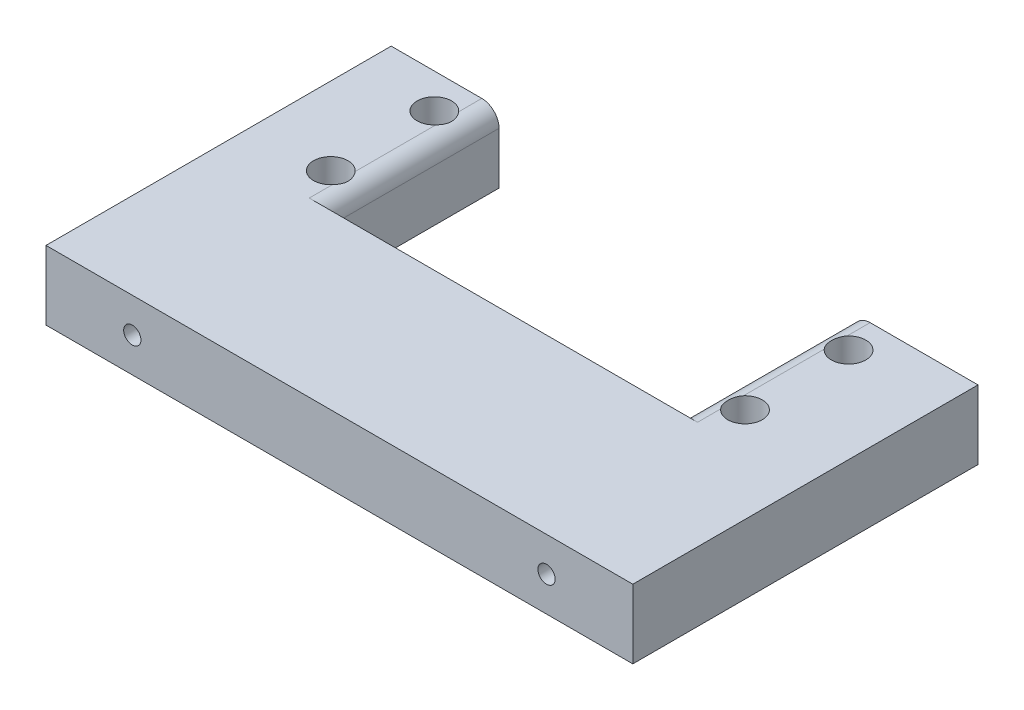
ISO-10303-21;
HEADER;
FILE_DESCRIPTION(('STEP AP214'),'2;1');
FILE_NAME('part.step','',(''),(''),'','','');
FILE_SCHEMA(('AUTOMOTIVE_DESIGN { 1 0 10303 214 1 1 1 1 }'));
ENDSEC;
DATA;
#1=APPLICATION_CONTEXT('core data for automotive mechanical design processes');
#2=APPLICATION_PROTOCOL_DEFINITION('international standard','automotive_design',2000,#1);
#3=PRODUCT_CONTEXT('',#1,'mechanical');
#4=PRODUCT('Part','Part','',(#3));
#5=PRODUCT_RELATED_PRODUCT_CATEGORY('part','',(#4));
#6=PRODUCT_DEFINITION_FORMATION('','',#4);
#7=PRODUCT_DEFINITION_CONTEXT('part definition',#1,'design');
#8=PRODUCT_DEFINITION('design','',#6,#7);
#9=PRODUCT_DEFINITION_SHAPE('','',#8);
#10=(LENGTH_UNIT() NAMED_UNIT(*) SI_UNIT(.MILLI.,.METRE.));
#11=(NAMED_UNIT(*) PLANE_ANGLE_UNIT() SI_UNIT($,.RADIAN.));
#12=(NAMED_UNIT(*) SI_UNIT($,.STERADIAN.) SOLID_ANGLE_UNIT());
#13=UNCERTAINTY_MEASURE_WITH_UNIT(LENGTH_MEASURE(1.E-05),#10,'distance_accuracy_value','');
#14=(GEOMETRIC_REPRESENTATION_CONTEXT(3) GLOBAL_UNCERTAINTY_ASSIGNED_CONTEXT((#13)) GLOBAL_UNIT_ASSIGNED_CONTEXT((#10,
#11,#12)) REPRESENTATION_CONTEXT('',''));
#15=CARTESIAN_POINT('',(0.,0.,0.));
#16=DIRECTION('',(0.,0.,1.));
#17=DIRECTION('',(1.,0.,0.));
#18=AXIS2_PLACEMENT_3D('',#15,#16,#17);
#19=CARTESIAN_POINT('',(0.,8.,0.));
#20=DIRECTION('',(0.,1.,0.));
#21=DIRECTION('',(0.,0.,1.));
#22=AXIS2_PLACEMENT_3D('',#19,#20,#21);
#23=PLANE('',#22);
#24=CARTESIAN_POINT('',(-25.4524886877828,8.,-6.27896621397598));
#25=DIRECTION('',(0.,1.,0.));
#26=DIRECTION('',(0.,0.,1.));
#27=AXIS2_PLACEMENT_3D('',#24,#25,#26);
#28=CIRCLE('',#27,2.);
#29=CARTESIAN_POINT('',(-23.9524886877828,8.,-7.60184186950828));
#30=VERTEX_POINT('',#29);
#31=CARTESIAN_POINT('',(-23.9524886877828,8.,-4.95609055844368));
#32=VERTEX_POINT('',#31);
#33=EDGE_CURVE('E251',#30,#32,#28,.T.);
#34=ORIENTED_EDGE('',*,*,#33,.F.);
#35=DIRECTION('',(0.,0.,-1.));
#36=VECTOR('',#35,1.);
#37=CARTESIAN_POINT('',(-23.9524886877828,8.,-22.278966213976));
#38=LINE('',#37,#36);
#39=CARTESIAN_POINT('',(-23.9524886877828,8.,-16.9560905584437));
#40=VERTEX_POINT('',#39);
#41=EDGE_CURVE('E177',#30,#40,#38,.T.);
#42=ORIENTED_EDGE('',*,*,#41,.T.);
#43=CARTESIAN_POINT('',(-25.4524886877828,8.,-18.278966213976));
#44=DIRECTION('',(0.,1.,0.));
#45=DIRECTION('',(0.,0.,1.));
#46=AXIS2_PLACEMENT_3D('',#43,#44,#45);
#47=CIRCLE('',#46,2.);
#48=CARTESIAN_POINT('',(-23.9524886877828,8.,-19.6018418695083));
#49=VERTEX_POINT('',#48);
#50=EDGE_CURVE('E245',#49,#40,#47,.T.);
#51=ORIENTED_EDGE('',*,*,#50,.F.);
#52=DIRECTION('',(0.,0.,-1.));
#53=VECTOR('',#52,1.);
#54=CARTESIAN_POINT('',(-23.9524886877828,8.,-22.278966213976));
#55=LINE('',#54,#53);
#56=CARTESIAN_POINT('',(-23.9524886877828,8.,-22.278966213976));
#57=VERTEX_POINT('',#56);
#58=EDGE_CURVE('E175',#49,#57,#55,.T.);
#59=ORIENTED_EDGE('',*,*,#58,.T.);
#60=DIRECTION('',(-1.,0.,0.));
#61=VECTOR('',#60,1.);
#62=CARTESIAN_POINT('',(-34.4524886877828,8.,-22.278966213976));
#63=LINE('',#62,#61);
#64=CARTESIAN_POINT('',(-34.4524886877828,8.,-22.278966213976));
#65=VERTEX_POINT('',#64);
#66=EDGE_CURVE('E150',#57,#65,#63,.T.);
#67=ORIENTED_EDGE('',*,*,#66,.T.);
#68=DIRECTION('',(0.,0.,1.));
#69=VECTOR('',#68,1.);
#70=CARTESIAN_POINT('',(-34.4524886877828,8.,-22.278966213976));
#71=LINE('',#70,#69);
#72=CARTESIAN_POINT('',(-34.4524886877828,8.,17.721033786024));
#73=VERTEX_POINT('',#72);
#74=EDGE_CURVE('E145',#65,#73,#71,.T.);
#75=ORIENTED_EDGE('',*,*,#74,.T.);
#76=DIRECTION('',(1.,0.,0.));
#77=VECTOR('',#76,1.);
#78=CARTESIAN_POINT('',(-34.4524886877828,8.,17.721033786024));
#79=LINE('',#78,#77);
#80=CARTESIAN_POINT('',(33.5475113122172,8.,17.721033786024));
#81=VERTEX_POINT('',#80);
#82=EDGE_CURVE('E134',#73,#81,#79,.T.);
#83=ORIENTED_EDGE('',*,*,#82,.T.);
#84=DIRECTION('',(0.,0.,-1.));
#85=VECTOR('',#84,1.);
#86=CARTESIAN_POINT('',(33.5475113122172,8.,-22.278966213976));
#87=LINE('',#86,#85);
#88=CARTESIAN_POINT('',(33.5475113122172,8.,-22.278966213976));
#89=VERTEX_POINT('',#88);
#90=EDGE_CURVE('E144',#81,#89,#87,.T.);
#91=ORIENTED_EDGE('',*,*,#90,.T.);
#92=DIRECTION('',(-1.,0.,0.));
#93=VECTOR('',#92,1.);
#94=CARTESIAN_POINT('',(19.0475113122172,8.,-22.278966213976));
#95=LINE('',#94,#93);
#96=CARTESIAN_POINT('',(21.0475113122172,8.,-22.278966213976));
#97=VERTEX_POINT('',#96);
#98=EDGE_CURVE('E260',#89,#97,#95,.T.);
#99=ORIENTED_EDGE('',*,*,#98,.T.);
#100=DIRECTION('',(0.,0.,1.));
#101=VECTOR('',#100,1.);
#102=CARTESIAN_POINT('',(21.0475113122172,8.,-2.27896621397598));
#103=LINE('',#102,#101);
#104=CARTESIAN_POINT('',(21.0475113122172,8.,-19.6018418695083));
#105=VERTEX_POINT('',#104);
#106=EDGE_CURVE('E169',#97,#105,#103,.T.);
#107=ORIENTED_EDGE('',*,*,#106,.T.);
#108=CARTESIAN_POINT('',(22.5475113122172,8.,-18.278966213976));
#109=DIRECTION('',(0.,1.,0.));
#110=DIRECTION('',(0.,0.,1.));
#111=AXIS2_PLACEMENT_3D('',#108,#109,#110);
#112=CIRCLE('',#111,2.);
#113=CARTESIAN_POINT('',(21.0475113122172,8.,-16.9560905584437));
#114=VERTEX_POINT('',#113);
#115=EDGE_CURVE('E335',#114,#105,#112,.T.);
#116=ORIENTED_EDGE('',*,*,#115,.F.);
#117=DIRECTION('',(0.,0.,1.));
#118=VECTOR('',#117,1.);
#119=CARTESIAN_POINT('',(21.0475113122172,8.,-2.27896621397598));
#120=LINE('',#119,#118);
#121=CARTESIAN_POINT('',(21.0475113122172,8.,-7.60184186950828));
#122=VERTEX_POINT('',#121);
#123=EDGE_CURVE('E162',#114,#122,#120,.T.);
#124=ORIENTED_EDGE('',*,*,#123,.T.);
#125=CARTESIAN_POINT('',(22.5475113122172,8.,-6.27896621397598));
#126=DIRECTION('',(0.,1.,0.));
#127=DIRECTION('',(0.,0.,1.));
#128=AXIS2_PLACEMENT_3D('',#125,#126,#127);
#129=CIRCLE('',#128,2.);
#130=CARTESIAN_POINT('',(21.0475113122172,8.,-4.95609055844369));
#131=VERTEX_POINT('',#130);
#132=EDGE_CURVE('E340',#131,#122,#129,.T.);
#133=ORIENTED_EDGE('',*,*,#132,.F.);
#134=DIRECTION('',(0.,0.,1.));
#135=VECTOR('',#134,1.);
#136=CARTESIAN_POINT('',(21.0475113122172,8.,-2.27896621397598));
#137=LINE('',#136,#135);
#138=CARTESIAN_POINT('',(21.0475113122172,8.,-2.27896621397598));
#139=VERTEX_POINT('',#138);
#140=EDGE_CURVE('E159',#131,#139,#137,.T.);
#141=ORIENTED_EDGE('',*,*,#140,.T.);
#142=DIRECTION('',(-1.,0.,0.));
#143=VECTOR('',#142,1.);
#144=CARTESIAN_POINT('',(-21.9524886877828,8.,-2.27896621397598));
#145=LINE('',#144,#143);
#146=CARTESIAN_POINT('',(-23.9524886877828,8.,-2.27896621397598));
#147=VERTEX_POINT('',#146);
#148=EDGE_CURVE('E263',#139,#147,#145,.T.);
#149=ORIENTED_EDGE('',*,*,#148,.T.);
#150=DIRECTION('',(0.,0.,-1.));
#151=VECTOR('',#150,1.);
#152=CARTESIAN_POINT('',(-23.9524886877828,8.,-22.278966213976));
#153=LINE('',#152,#151);
#154=EDGE_CURVE('E172',#147,#32,#153,.T.);
#155=ORIENTED_EDGE('',*,*,#154,.T.);
#156=EDGE_LOOP('',(#34,#42,#51,#59,#67,#75,#83,#91,#99,#107,#116,#124,#133,#141,#149,#155));
#157=FACE_BOUND('',#156,.T.);
#158=ADVANCED_FACE('F34',(#157),#23,.T.);
#159=CARTESIAN_POINT('',(0.,0.,0.));
#160=DIRECTION('',(0.,1.,0.));
#161=DIRECTION('',(0.,0.,1.));
#162=AXIS2_PLACEMENT_3D('',#159,#160,#161);
#163=PLANE('',#162);
#164=DIRECTION('',(0.,0.,1.));
#165=VECTOR('',#164,1.);
#166=CARTESIAN_POINT('',(-34.4524886877828,0.,-22.278966213976));
#167=LINE('',#166,#165);
#168=CARTESIAN_POINT('',(-34.4524886877828,0.,-22.278966213976));
#169=VERTEX_POINT('',#168);
#170=CARTESIAN_POINT('',(-34.4524886877828,0.,17.721033786024));
#171=VERTEX_POINT('',#170);
#172=EDGE_CURVE('E158',#169,#171,#167,.T.);
#173=ORIENTED_EDGE('',*,*,#172,.F.);
#174=DIRECTION('',(-1.,0.,0.));
#175=VECTOR('',#174,1.);
#176=CARTESIAN_POINT('',(-34.4524886877828,0.,-22.278966213976));
#177=LINE('',#176,#175);
#178=CARTESIAN_POINT('',(-21.9524886877828,0.,-22.278966213976));
#179=VERTEX_POINT('',#178);
#180=EDGE_CURVE('E154',#179,#169,#177,.T.);
#181=ORIENTED_EDGE('',*,*,#180,.F.);
#182=DIRECTION('',(0.,0.,-1.));
#183=VECTOR('',#182,1.);
#184=CARTESIAN_POINT('',(-21.9524886877828,0.,-22.278966213976));
#185=LINE('',#184,#183);
#186=CARTESIAN_POINT('',(-21.9524886877828,0.,-2.27896621397598));
#187=VERTEX_POINT('',#186);
#188=EDGE_CURVE('E281',#187,#179,#185,.T.);
#189=ORIENTED_EDGE('',*,*,#188,.F.);
#190=DIRECTION('',(-1.,0.,0.));
#191=VECTOR('',#190,1.);
#192=CARTESIAN_POINT('',(-21.9524886877828,0.,-2.27896621397598));
#193=LINE('',#192,#191);
#194=CARTESIAN_POINT('',(19.0475113122172,0.,-2.27896621397598));
#195=VERTEX_POINT('',#194);
#196=EDGE_CURVE('E278',#195,#187,#193,.T.);
#197=ORIENTED_EDGE('',*,*,#196,.F.);
#198=DIRECTION('',(0.,0.,1.));
#199=VECTOR('',#198,1.);
#200=CARTESIAN_POINT('',(19.0475113122172,0.,-22.278966213976));
#201=LINE('',#200,#199);
#202=CARTESIAN_POINT('',(19.0475113122172,0.,-22.278966213976));
#203=VERTEX_POINT('',#202);
#204=EDGE_CURVE('E275',#203,#195,#201,.T.);
#205=ORIENTED_EDGE('',*,*,#204,.F.);
#206=DIRECTION('',(-1.,0.,0.));
#207=VECTOR('',#206,1.);
#208=CARTESIAN_POINT('',(19.0475113122172,0.,-22.278966213976));
#209=LINE('',#208,#207);
#210=CARTESIAN_POINT('',(33.5475113122172,0.,-22.278966213976));
#211=VERTEX_POINT('',#210);
#212=EDGE_CURVE('E272',#211,#203,#209,.T.);
#213=ORIENTED_EDGE('',*,*,#212,.F.);
#214=DIRECTION('',(0.,0.,-1.));
#215=VECTOR('',#214,1.);
#216=CARTESIAN_POINT('',(33.5475113122172,0.,-22.278966213976));
#217=LINE('',#216,#215);
#218=CARTESIAN_POINT('',(33.5475113122172,0.,17.721033786024));
#219=VERTEX_POINT('',#218);
#220=EDGE_CURVE('E270',#219,#211,#217,.T.);
#221=ORIENTED_EDGE('',*,*,#220,.F.);
#222=DIRECTION('',(1.,0.,0.));
#223=VECTOR('',#222,1.);
#224=CARTESIAN_POINT('',(-34.4524886877828,0.,17.721033786024));
#225=LINE('',#224,#223);
#226=EDGE_CURVE('E268',#171,#219,#225,.T.);
#227=ORIENTED_EDGE('',*,*,#226,.F.);
#228=EDGE_LOOP('',(#173,#181,#189,#197,#205,#213,#221,#227));
#229=FACE_BOUND('',#228,.T.);
#230=CARTESIAN_POINT('',(-25.4524886877828,0.,-18.278966213976));
#231=DIRECTION('',(0.,1.,0.));
#232=DIRECTION('',(0.,0.,1.));
#233=AXIS2_PLACEMENT_3D('',#230,#231,#232);
#234=CIRCLE('',#233,2.);
#235=CARTESIAN_POINT('',(-25.4524886877828,0.,-16.278966213976));
#236=VERTEX_POINT('',#235);
#237=EDGE_CURVE('E249',#236,#236,#234,.T.);
#238=ORIENTED_EDGE('',*,*,#237,.T.);
#239=EDGE_LOOP('',(#238));
#240=FACE_BOUND('',#239,.T.);
#241=CARTESIAN_POINT('',(-25.4524886877828,0.,-6.27896621397598));
#242=DIRECTION('',(0.,1.,0.));
#243=DIRECTION('',(0.,0.,1.));
#244=AXIS2_PLACEMENT_3D('',#241,#242,#243);
#245=CIRCLE('',#244,2.);
#246=CARTESIAN_POINT('',(-25.4524886877828,0.,-4.27896621397598));
#247=VERTEX_POINT('',#246);
#248=EDGE_CURVE('E255',#247,#247,#245,.T.);
#249=ORIENTED_EDGE('',*,*,#248,.T.);
#250=EDGE_LOOP('',(#249));
#251=FACE_BOUND('',#250,.T.);
#252=CARTESIAN_POINT('',(22.5475113122172,0.,-18.278966213976));
#253=DIRECTION('',(0.,1.,0.));
#254=DIRECTION('',(0.,0.,1.));
#255=AXIS2_PLACEMENT_3D('',#252,#253,#254);
#256=CIRCLE('',#255,2.);
#257=CARTESIAN_POINT('',(22.5475113122172,0.,-16.278966213976));
#258=VERTEX_POINT('',#257);
#259=EDGE_CURVE('E338',#258,#258,#256,.T.);
#260=ORIENTED_EDGE('',*,*,#259,.T.);
#261=EDGE_LOOP('',(#260));
#262=FACE_BOUND('',#261,.T.);
#263=CARTESIAN_POINT('',(22.5475113122172,0.,-6.27896621397598));
#264=DIRECTION('',(0.,1.,0.));
#265=DIRECTION('',(0.,0.,1.));
#266=AXIS2_PLACEMENT_3D('',#263,#264,#265);
#267=CIRCLE('',#266,2.);
#268=CARTESIAN_POINT('',(22.5475113122172,0.,-4.27896621397598));
#269=VERTEX_POINT('',#268);
#270=EDGE_CURVE('E344',#269,#269,#267,.T.);
#271=ORIENTED_EDGE('',*,*,#270,.T.);
#272=EDGE_LOOP('',(#271));
#273=FACE_BOUND('',#272,.T.);
#274=ADVANCED_FACE('F203',(#229,#240,#251,#262,#273),#163,.F.);
#275=CARTESIAN_POINT('',(-34.4524886877828,8.,-22.278966213976));
#276=DIRECTION('',(1.,0.,0.));
#277=DIRECTION('',(0.,0.,-1.));
#278=AXIS2_PLACEMENT_3D('',#275,#276,#277);
#279=PLANE('',#278);
#280=ORIENTED_EDGE('',*,*,#172,.T.);
#281=DIRECTION('',(0.,-1.,0.));
#282=VECTOR('',#281,1.);
#283=CARTESIAN_POINT('',(-34.4524886877828,8.,17.721033786024));
#284=LINE('',#283,#282);
#285=EDGE_CURVE('E138',#73,#171,#284,.T.);
#286=ORIENTED_EDGE('',*,*,#285,.F.);
#287=ORIENTED_EDGE('',*,*,#74,.F.);
#288=DIRECTION('',(0.,-1.,0.));
#289=VECTOR('',#288,1.);
#290=CARTESIAN_POINT('',(-34.4524886877828,8.,-22.278966213976));
#291=LINE('',#290,#289);
#292=EDGE_CURVE('E266',#65,#169,#291,.T.);
#293=ORIENTED_EDGE('',*,*,#292,.T.);
#294=EDGE_LOOP('',(#280,#286,#287,#293));
#295=FACE_BOUND('',#294,.T.);
#296=ADVANCED_FACE('F156',(#295),#279,.F.);
#297=CARTESIAN_POINT('',(-34.4524886877828,8.,17.721033786024));
#298=DIRECTION('',(0.,0.,-1.));
#299=DIRECTION('',(-1.,0.,0.));
#300=AXIS2_PLACEMENT_3D('',#297,#298,#299);
#301=PLANE('',#300);
#302=CARTESIAN_POINT('',(23.5475113122172,4.,17.721033786024));
#303=DIRECTION('',(0.,0.,-1.));
#304=DIRECTION('',(-1.,0.,0.));
#305=AXIS2_PLACEMENT_3D('',#302,#303,#304);
#306=CIRCLE('',#305,0.999999999999998);
#307=CARTESIAN_POINT('',(22.5475113122172,4.,17.721033786024));
#308=VERTEX_POINT('',#307);
#309=EDGE_CURVE('E363',#308,#308,#306,.T.);
#310=ORIENTED_EDGE('',*,*,#309,.T.);
#311=EDGE_LOOP('',(#310));
#312=FACE_BOUND('',#311,.T.);
#313=CARTESIAN_POINT('',(-24.4524886877828,4.,17.721033786024));
#314=DIRECTION('',(0.,0.,-1.));
#315=DIRECTION('',(-1.,0.,0.));
#316=AXIS2_PLACEMENT_3D('',#313,#314,#315);
#317=CIRCLE('',#316,1.);
#318=CARTESIAN_POINT('',(-25.4524886877828,4.,17.721033786024));
#319=VERTEX_POINT('',#318);
#320=EDGE_CURVE('E357',#319,#319,#317,.T.);
#321=ORIENTED_EDGE('',*,*,#320,.T.);
#322=EDGE_LOOP('',(#321));
#323=FACE_BOUND('',#322,.T.);
#324=ORIENTED_EDGE('',*,*,#226,.T.);
#325=DIRECTION('',(0.,-1.,0.));
#326=VECTOR('',#325,1.);
#327=CARTESIAN_POINT('',(33.5475113122172,8.,17.721033786024));
#328=LINE('',#327,#326);
#329=EDGE_CURVE('E141',#81,#219,#328,.T.);
#330=ORIENTED_EDGE('',*,*,#329,.F.);
#331=ORIENTED_EDGE('',*,*,#82,.F.);
#332=ORIENTED_EDGE('',*,*,#285,.T.);
#333=EDGE_LOOP('',(#324,#330,#331,#332));
#334=FACE_BOUND('',#333,.T.);
#335=ADVANCED_FACE('F136',(#312,#323,#334),#301,.F.);
#336=CARTESIAN_POINT('',(33.5475113122172,8.,-22.278966213976));
#337=DIRECTION('',(-1.,0.,0.));
#338=DIRECTION('',(0.,0.,1.));
#339=AXIS2_PLACEMENT_3D('',#336,#337,#338);
#340=PLANE('',#339);
#341=ORIENTED_EDGE('',*,*,#220,.T.);
#342=DIRECTION('',(0.,-1.,0.));
#343=VECTOR('',#342,1.);
#344=CARTESIAN_POINT('',(33.5475113122172,8.,-22.278966213976));
#345=LINE('',#344,#343);
#346=EDGE_CURVE('E164',#89,#211,#345,.T.);
#347=ORIENTED_EDGE('',*,*,#346,.F.);
#348=ORIENTED_EDGE('',*,*,#90,.F.);
#349=ORIENTED_EDGE('',*,*,#329,.T.);
#350=EDGE_LOOP('',(#341,#347,#348,#349));
#351=FACE_BOUND('',#350,.T.);
#352=ADVANCED_FACE('F206',(#351),#340,.F.);
#353=CARTESIAN_POINT('',(19.0475113122172,8.,-22.278966213976));
#354=DIRECTION('',(0.,0.,1.));
#355=DIRECTION('',(1.,0.,0.));
#356=AXIS2_PLACEMENT_3D('',#353,#354,#355);
#357=PLANE('',#356);
#358=DIRECTION('',(0.,-1.,0.));
#359=VECTOR('',#358,1.);
#360=CARTESIAN_POINT('',(19.0475113122172,8.,-22.278966213976));
#361=LINE('',#360,#359);
#362=CARTESIAN_POINT('',(19.0475113122172,6.,-22.278966213976));
#363=VERTEX_POINT('',#362);
#364=EDGE_CURVE('E292',#363,#203,#361,.T.);
#365=ORIENTED_EDGE('',*,*,#364,.F.);
#366=CARTESIAN_POINT('',(21.0475113122172,6.,-22.278966213976));
#367=DIRECTION('',(0.,0.,1.));
#368=DIRECTION('',(1.,0.,0.));
#369=AXIS2_PLACEMENT_3D('',#366,#367,#368);
#370=CIRCLE('',#369,2.);
#371=EDGE_CURVE('E302',#363,#97,#370,.F.);
#372=ORIENTED_EDGE('',*,*,#371,.T.);
#373=ORIENTED_EDGE('',*,*,#98,.F.);
#374=ORIENTED_EDGE('',*,*,#346,.T.);
#375=ORIENTED_EDGE('',*,*,#212,.T.);
#376=EDGE_LOOP('',(#365,#372,#373,#374,#375));
#377=FACE_BOUND('',#376,.T.);
#378=ADVANCED_FACE('F210',(#377),#357,.F.);
#379=CARTESIAN_POINT('',(19.0475113122172,8.,-22.278966213976));
#380=DIRECTION('',(1.,0.,0.));
#381=DIRECTION('',(0.,0.,-1.));
#382=AXIS2_PLACEMENT_3D('',#379,#380,#381);
#383=PLANE('',#382);
#384=DIRECTION('',(0.,-1.,0.));
#385=VECTOR('',#384,1.);
#386=CARTESIAN_POINT('',(19.0475113122172,8.,-2.27896621397598));
#387=LINE('',#386,#385);
#388=CARTESIAN_POINT('',(19.0475113122172,6.,-2.27896621397598));
#389=VERTEX_POINT('',#388);
#390=EDGE_CURVE('E290',#389,#195,#387,.T.);
#391=ORIENTED_EDGE('',*,*,#390,.F.);
#392=DIRECTION('',(0.,0.,1.));
#393=VECTOR('',#392,1.);
#394=CARTESIAN_POINT('',(19.0475113122172,6.,-22.278966213976));
#395=LINE('',#394,#393);
#396=EDGE_CURVE('E50',#389,#363,#395,.F.);
#397=ORIENTED_EDGE('',*,*,#396,.T.);
#398=ORIENTED_EDGE('',*,*,#364,.T.);
#399=ORIENTED_EDGE('',*,*,#204,.T.);
#400=EDGE_LOOP('',(#391,#397,#398,#399));
#401=FACE_BOUND('',#400,.T.);
#402=ADVANCED_FACE('F214',(#401),#383,.F.);
#403=CARTESIAN_POINT('',(-21.9524886877828,8.,-2.27896621397598));
#404=DIRECTION('',(0.,0.,1.));
#405=DIRECTION('',(1.,0.,0.));
#406=AXIS2_PLACEMENT_3D('',#403,#404,#405);
#407=PLANE('',#406);
#408=ORIENTED_EDGE('',*,*,#196,.T.);
#409=DIRECTION('',(0.,-1.,0.));
#410=VECTOR('',#409,1.);
#411=CARTESIAN_POINT('',(-21.9524886877828,8.,-2.27896621397598));
#412=LINE('',#411,#410);
#413=CARTESIAN_POINT('',(-21.9524886877828,6.,-2.27896621397598));
#414=VERTEX_POINT('',#413);
#415=EDGE_CURVE('E288',#414,#187,#412,.T.);
#416=ORIENTED_EDGE('',*,*,#415,.F.);
#417=CARTESIAN_POINT('',(-23.9524886877828,6.,-2.27896621397598));
#418=DIRECTION('',(0.,0.,1.));
#419=DIRECTION('',(1.,0.,0.));
#420=AXIS2_PLACEMENT_3D('',#417,#418,#419);
#421=CIRCLE('',#420,2.);
#422=EDGE_CURVE('E43',#414,#147,#421,.T.);
#423=ORIENTED_EDGE('',*,*,#422,.T.);
#424=ORIENTED_EDGE('',*,*,#148,.F.);
#425=CARTESIAN_POINT('',(21.0475113122172,6.,-2.27896621397598));
#426=DIRECTION('',(0.,0.,1.));
#427=DIRECTION('',(1.,0.,0.));
#428=AXIS2_PLACEMENT_3D('',#425,#426,#427);
#429=CIRCLE('',#428,2.);
#430=EDGE_CURVE('E11',#139,#389,#429,.T.);
#431=ORIENTED_EDGE('',*,*,#430,.T.);
#432=ORIENTED_EDGE('',*,*,#390,.T.);
#433=EDGE_LOOP('',(#408,#416,#423,#424,#431,#432));
#434=FACE_BOUND('',#433,.T.);
#435=ADVANCED_FACE('F218',(#434),#407,.F.);
#436=CARTESIAN_POINT('',(-21.9524886877828,8.,-22.278966213976));
#437=DIRECTION('',(-1.,0.,0.));
#438=DIRECTION('',(0.,0.,1.));
#439=AXIS2_PLACEMENT_3D('',#436,#437,#438);
#440=PLANE('',#439);
#441=DIRECTION('',(0.,-1.,0.));
#442=VECTOR('',#441,1.);
#443=CARTESIAN_POINT('',(-21.9524886877828,8.,-22.278966213976));
#444=LINE('',#443,#442);
#445=CARTESIAN_POINT('',(-21.9524886877828,6.,-22.278966213976));
#446=VERTEX_POINT('',#445);
#447=EDGE_CURVE('E286',#446,#179,#444,.T.);
#448=ORIENTED_EDGE('',*,*,#447,.F.);
#449=DIRECTION('',(0.,0.,-1.));
#450=VECTOR('',#449,1.);
#451=CARTESIAN_POINT('',(-21.9524886877828,6.,-2.27896621397598));
#452=LINE('',#451,#450);
#453=EDGE_CURVE('E515',#446,#414,#452,.F.);
#454=ORIENTED_EDGE('',*,*,#453,.T.);
#455=ORIENTED_EDGE('',*,*,#415,.T.);
#456=ORIENTED_EDGE('',*,*,#188,.T.);
#457=EDGE_LOOP('',(#448,#454,#455,#456));
#458=FACE_BOUND('',#457,.T.);
#459=ADVANCED_FACE('F221',(#458),#440,.F.);
#460=CARTESIAN_POINT('',(-34.4524886877828,8.,-22.278966213976));
#461=DIRECTION('',(0.,0.,1.));
#462=DIRECTION('',(1.,0.,0.));
#463=AXIS2_PLACEMENT_3D('',#460,#461,#462);
#464=PLANE('',#463);
#465=ORIENTED_EDGE('',*,*,#66,.F.);
#466=CARTESIAN_POINT('',(-23.9524886877828,6.,-22.278966213976));
#467=DIRECTION('',(0.,0.,1.));
#468=DIRECTION('',(1.,0.,0.));
#469=AXIS2_PLACEMENT_3D('',#466,#467,#468);
#470=CIRCLE('',#469,2.);
#471=EDGE_CURVE('E514',#57,#446,#470,.F.);
#472=ORIENTED_EDGE('',*,*,#471,.T.);
#473=ORIENTED_EDGE('',*,*,#447,.T.);
#474=ORIENTED_EDGE('',*,*,#180,.T.);
#475=ORIENTED_EDGE('',*,*,#292,.F.);
#476=EDGE_LOOP('',(#465,#472,#473,#474,#475));
#477=FACE_BOUND('',#476,.T.);
#478=ADVANCED_FACE('F224',(#477),#464,.F.);
#479=CARTESIAN_POINT('',(-25.4524886877828,8.,-18.278966213976));
#480=DIRECTION('',(0.,-1.,0.));
#481=DIRECTION('',(0.,0.,-1.));
#482=AXIS2_PLACEMENT_3D('',#479,#480,#481);
#483=CYLINDRICAL_SURFACE('',#482,2.);
#484=ORIENTED_EDGE('',*,*,#50,.T.);
#485=CARTESIAN_POINT('',(-23.9524886877828,8.,-16.9560905584437));
#486=CARTESIAN_POINT('',(-23.9155328072478,7.9999966487693,-16.9979930117273));
#487=CARTESIAN_POINT('',(-23.8803640955142,7.99897644573893,-17.0414131666606));
#488=CARTESIAN_POINT('',(-23.8138172632822,7.99546532257662,-17.130981808538));
#489=CARTESIAN_POINT('',(-23.7824373268239,7.99297511041775,-17.1771289725026));
#490=CARTESIAN_POINT('',(-23.6942937863957,7.98414525020555,-17.3191993140238));
#491=CARTESIAN_POINT('',(-23.6434757369301,7.97644484666166,-17.4188090135121));
#492=CARTESIAN_POINT('',(-23.5591459331191,7.96140944847199,-17.6250024760174));
#493=CARTESIAN_POINT('',(-23.5256243953312,7.95407424938152,-17.7315822580127));
#494=CARTESIAN_POINT('',(-23.4767696620706,7.94276335765907,-17.94894291864));
#495=CARTESIAN_POINT('',(-23.46141946385,7.93878452551051,-18.0597197697711));
#496=CARTESIAN_POINT('',(-23.4493997119735,7.93570246709128,-18.282110075683));
#497=CARTESIAN_POINT('',(-23.4526892885022,7.93658857375916,-18.3937211646738));
#498=CARTESIAN_POINT('',(-23.4777497819709,7.94287982751674,-18.6148167137368));
#499=CARTESIAN_POINT('',(-23.4995386686079,7.94828936846301,-18.724299000143));
#500=CARTESIAN_POINT('',(-23.5605026705465,7.96145276091021,-18.9365697247983));
#501=CARTESIAN_POINT('',(-23.5994492230014,7.96917538000887,-19.0394264357059));
#502=CARTESIAN_POINT('',(-23.6936431292239,7.98374718148196,-19.2373098546358));
#503=CARTESIAN_POINT('',(-23.7488585641425,7.99059803688246,-19.3323514329133));
#504=CARTESIAN_POINT('',(-23.8332347733113,7.99656016319359,-19.4534765719417));
#505=CARTESIAN_POINT('',(-23.8559025609035,7.99780510069914,-19.4841082451364));
#506=CARTESIAN_POINT('',(-23.9029352527237,7.99952441213544,-19.5440075495035));
#507=CARTESIAN_POINT('',(-23.9272982797301,7.99999962469169,-19.5732766314097));
#508=CARTESIAN_POINT('',(-23.9524886877828,8.,-19.6018418695083));
#509=B_SPLINE_CURVE_WITH_KNOTS('',3,(#485,#486,#487,#488,#489,#490,#491,#492,#493,#494,#495,
#496,#497,#498,#499,#500,#501,#502,#503,#504,#505,#506,#507,#508),.UNSPECIFIED.,.F.,.F.,(4,2,2,
2,2,2,2,2,2,2,2,4),(0.,0.167477675629048,0.334874757840205,0.669441527780778,1.00381884837279,
1.33788304739092,1.6712150566874,2.00487122603467,2.33421106232491,2.66290900236802,
2.77723635481402,2.89143906210895),.UNSPECIFIED.);
#510=EDGE_CURVE('E185',#40,#49,#509,.T.);
#511=ORIENTED_EDGE('',*,*,#510,.T.);
#512=EDGE_LOOP('',(#484,#511));
#513=FACE_BOUND('',#512,.T.);
#514=ORIENTED_EDGE('',*,*,#237,.F.);
#515=EDGE_LOOP('',(#514));
#516=FACE_BOUND('',#515,.T.);
#517=ADVANCED_FACE('F228',(#513,#516),#483,.F.);
#518=CARTESIAN_POINT('',(-25.4524886877828,8.,-6.27896621397598));
#519=DIRECTION('',(0.,-1.,0.));
#520=DIRECTION('',(0.,0.,-1.));
#521=AXIS2_PLACEMENT_3D('',#518,#519,#520);
#522=CYLINDRICAL_SURFACE('',#521,2.);
#523=ORIENTED_EDGE('',*,*,#33,.T.);
#524=CARTESIAN_POINT('',(-23.9524886877828,8.,-4.95609055844368));
#525=CARTESIAN_POINT('',(-23.9155328072478,7.9999966487693,-4.99799301172732));
#526=CARTESIAN_POINT('',(-23.8803640955142,7.99897644573893,-5.04141316666056));
#527=CARTESIAN_POINT('',(-23.8138172632822,7.99546532257662,-5.13098180853804));
#528=CARTESIAN_POINT('',(-23.7824373268239,7.99297511041775,-5.17712897250257));
#529=CARTESIAN_POINT('',(-23.6942937863957,7.98414525020555,-5.31919931402384));
#530=CARTESIAN_POINT('',(-23.6434757369301,7.97644484666166,-5.41880901351215));
#531=CARTESIAN_POINT('',(-23.5591459331191,7.96140944847199,-5.62500247601737));
#532=CARTESIAN_POINT('',(-23.5256243953312,7.95407424938151,-5.73158225801267));
#533=CARTESIAN_POINT('',(-23.4767696620706,7.94276335765907,-5.94894291864003));
#534=CARTESIAN_POINT('',(-23.46141946385,7.93878452551051,-6.05971976977107));
#535=CARTESIAN_POINT('',(-23.4493997119735,7.93570246709127,-6.28211007568304));
#536=CARTESIAN_POINT('',(-23.4526892885022,7.93658857375916,-6.39372116467376));
#537=CARTESIAN_POINT('',(-23.4777497819709,7.94287982751674,-6.61481671373678));
#538=CARTESIAN_POINT('',(-23.4995386686079,7.94828936846301,-6.72429900014305));
#539=CARTESIAN_POINT('',(-23.5605026705465,7.96145276091021,-6.93656972479828));
#540=CARTESIAN_POINT('',(-23.5994492230014,7.96917538000887,-7.03942643570587));
#541=CARTESIAN_POINT('',(-23.6936431292239,7.98374718148196,-7.2373098546358));
#542=CARTESIAN_POINT('',(-23.7488585641425,7.99059803688246,-7.3323514329133));
#543=CARTESIAN_POINT('',(-23.8332347733113,7.99656016319359,-7.45347657194172));
#544=CARTESIAN_POINT('',(-23.8559025609035,7.99780510069914,-7.48410824513645));
#545=CARTESIAN_POINT('',(-23.9029352527237,7.99952441213544,-7.5440075495035));
#546=CARTESIAN_POINT('',(-23.9272982797301,7.99999962469169,-7.57327663140967));
#547=CARTESIAN_POINT('',(-23.9524886877828,8.,-7.60184186950828));
#548=B_SPLINE_CURVE_WITH_KNOTS('',3,(#524,#525,#526,#527,#528,#529,#530,#531,#532,#533,#534,
#535,#536,#537,#538,#539,#540,#541,#542,#543,#544,#545,#546,#547),.UNSPECIFIED.,.F.,.F.,(4,2,2,
2,2,2,2,2,2,2,2,4),(0.,0.167477675629043,0.334874757840205,0.669441527780778,1.00381884837279,
1.33788304739092,1.6712150566874,2.00487122603467,2.33421106232491,2.66290900236802,
2.77723635481403,2.89143906210895),.UNSPECIFIED.);
#549=EDGE_CURVE('E179',#32,#30,#548,.T.);
#550=ORIENTED_EDGE('',*,*,#549,.T.);
#551=EDGE_LOOP('',(#523,#550));
#552=FACE_BOUND('',#551,.T.);
#553=ORIENTED_EDGE('',*,*,#248,.F.);
#554=EDGE_LOOP('',(#553));
#555=FACE_BOUND('',#554,.T.);
#556=ADVANCED_FACE('F191',(#552,#555),#522,.F.);
#557=CARTESIAN_POINT('',(22.5475113122172,8.,-18.278966213976));
#558=DIRECTION('',(0.,-1.,0.));
#559=DIRECTION('',(0.,0.,-1.));
#560=AXIS2_PLACEMENT_3D('',#557,#558,#559);
#561=CYLINDRICAL_SURFACE('',#560,2.);
#562=ORIENTED_EDGE('',*,*,#115,.T.);
#563=CARTESIAN_POINT('',(21.0475113122172,8.,-19.6018418695083));
#564=CARTESIAN_POINT('',(21.0105554316821,7.9999966487693,-19.5599394162246));
#565=CARTESIAN_POINT('',(20.9753867199485,7.99897644573893,-19.5165192612914));
#566=CARTESIAN_POINT('',(20.9088398877165,7.99546532257662,-19.4269506194139));
#567=CARTESIAN_POINT('',(20.8774599512582,7.99297511041775,-19.3808034554494));
#568=CARTESIAN_POINT('',(20.7893164108301,7.98414525020555,-19.2387331139281));
#569=CARTESIAN_POINT('',(20.7384983613645,7.97644484666166,-19.1391234144398));
#570=CARTESIAN_POINT('',(20.6541685575535,7.96140944847199,-18.9329299519346));
#571=CARTESIAN_POINT('',(20.6206470197656,7.95407424938152,-18.8263501699393));
#572=CARTESIAN_POINT('',(20.571792286505,7.94276335765907,-18.6089895093119));
#573=CARTESIAN_POINT('',(20.5564420882843,7.93878452551051,-18.4982126581809));
#574=CARTESIAN_POINT('',(20.5444223364079,7.93570246709127,-18.2758223522689));
#575=CARTESIAN_POINT('',(20.5477119129366,7.93658857375916,-18.1642112632782));
#576=CARTESIAN_POINT('',(20.5727724064052,7.94287982751674,-17.9431157142152));
#577=CARTESIAN_POINT('',(20.5945612930423,7.94828936846301,-17.8336334278089));
#578=CARTESIAN_POINT('',(20.6555252949808,7.96145276091021,-17.6213627031537));
#579=CARTESIAN_POINT('',(20.6944718474358,7.96917538000887,-17.5185059922461));
#580=CARTESIAN_POINT('',(20.7886657536582,7.98374718148196,-17.3206225733162));
#581=CARTESIAN_POINT('',(20.8438811885769,7.99059803688246,-17.2255809950387));
#582=CARTESIAN_POINT('',(20.9282573977456,7.99656016319359,-17.1044558560102));
#583=CARTESIAN_POINT('',(20.9509251853379,7.99780510069914,-17.0738241828155));
#584=CARTESIAN_POINT('',(20.9979578771581,7.99952441213544,-17.0139248784485));
#585=CARTESIAN_POINT('',(21.0223209041644,7.99999962469169,-16.9846557965423));
#586=CARTESIAN_POINT('',(21.0475113122172,8.,-16.9560905584437));
#587=B_SPLINE_CURVE_WITH_KNOTS('',3,(#563,#564,#565,#566,#567,#568,#569,#570,#571,#572,#573,
#574,#575,#576,#577,#578,#579,#580,#581,#582,#583,#584,#585,#586),.UNSPECIFIED.,.F.,.F.,(4,2,2,
2,2,2,2,2,2,2,2,4),(0.,0.167477675629048,0.334874757840205,0.669441527780778,1.00381884837279,
1.33788304739092,1.6712150566874,2.00487122603467,2.33421106232491,2.66290900236802,
2.77723635481403,2.89143906210895),.UNSPECIFIED.);
#588=EDGE_CURVE('E315',#105,#114,#587,.T.);
#589=ORIENTED_EDGE('',*,*,#588,.T.);
#590=EDGE_LOOP('',(#562,#589));
#591=FACE_BOUND('',#590,.T.);
#592=ORIENTED_EDGE('',*,*,#259,.F.);
#593=EDGE_LOOP('',(#592));
#594=FACE_BOUND('',#593,.T.);
#595=ADVANCED_FACE('F240',(#591,#594),#561,.F.);
#596=CARTESIAN_POINT('',(22.5475113122172,8.,-6.27896621397598));
#597=DIRECTION('',(0.,-1.,0.));
#598=DIRECTION('',(0.,0.,-1.));
#599=AXIS2_PLACEMENT_3D('',#596,#597,#598);
#600=CYLINDRICAL_SURFACE('',#599,2.);
#601=ORIENTED_EDGE('',*,*,#132,.T.);
#602=CARTESIAN_POINT('',(21.0475113122172,8.,-7.60184186950828));
#603=CARTESIAN_POINT('',(21.0105554316821,7.9999966487693,-7.55993941622464));
#604=CARTESIAN_POINT('',(20.9753867199485,7.99897644573893,-7.51651926129141));
#605=CARTESIAN_POINT('',(20.9088398877165,7.99546532257662,-7.42695061941392));
#606=CARTESIAN_POINT('',(20.8774599512582,7.99297511041775,-7.38080345544939));
#607=CARTESIAN_POINT('',(20.7893164108301,7.98414525020555,-7.23873311392812));
#608=CARTESIAN_POINT('',(20.7384983613645,7.97644484666166,-7.13912341443981));
#609=CARTESIAN_POINT('',(20.6541685575535,7.96140944847199,-6.93292995193459));
#610=CARTESIAN_POINT('',(20.6206470197656,7.95407424938152,-6.82635016993929));
#611=CARTESIAN_POINT('',(20.571792286505,7.94276335765907,-6.60898950931194));
#612=CARTESIAN_POINT('',(20.5564420882844,7.93878452551051,-6.49821265818089));
#613=CARTESIAN_POINT('',(20.5444223364079,7.93570246709128,-6.27582235226892));
#614=CARTESIAN_POINT('',(20.5477119129366,7.93658857375916,-6.1642112632782));
#615=CARTESIAN_POINT('',(20.5727724064052,7.94287982751674,-5.94311571421518));
#616=CARTESIAN_POINT('',(20.5945612930423,7.94828936846301,-5.83363342780891));
#617=CARTESIAN_POINT('',(20.6555252949808,7.96145276091021,-5.62136270315368));
#618=CARTESIAN_POINT('',(20.6944718474358,7.96917538000887,-5.5185059922461));
#619=CARTESIAN_POINT('',(20.7886657536582,7.98374718148196,-5.32062257331616));
#620=CARTESIAN_POINT('',(20.8438811885769,7.99059803688246,-5.22558099503866));
#621=CARTESIAN_POINT('',(20.9282573977456,7.99656016319359,-5.10445585601024));
#622=CARTESIAN_POINT('',(20.9509251853379,7.99780510069914,-5.07382418281552));
#623=CARTESIAN_POINT('',(20.9979578771581,7.99952441213544,-5.01392487844847));
#624=CARTESIAN_POINT('',(21.0223209041644,7.99999962469169,-4.9846557965423));
#625=CARTESIAN_POINT('',(21.0475113122172,8.,-4.95609055844369));
#626=B_SPLINE_CURVE_WITH_KNOTS('',3,(#602,#603,#604,#605,#606,#607,#608,#609,#610,#611,#612,
#613,#614,#615,#616,#617,#618,#619,#620,#621,#622,#623,#624,#625),.UNSPECIFIED.,.F.,.F.,(4,2,2,
2,2,2,2,2,2,2,2,4),(0.,0.167477675629045,0.334874757840206,0.669441527780777,1.00381884837279,
1.33788304739092,1.6712150566874,2.00487122603467,2.3342110623249,2.66290900236802,
2.77723635481402,2.89143906210893),.UNSPECIFIED.);
#627=EDGE_CURVE('E307',#122,#131,#626,.T.);
#628=ORIENTED_EDGE('',*,*,#627,.T.);
#629=EDGE_LOOP('',(#601,#628));
#630=FACE_BOUND('',#629,.T.);
#631=ORIENTED_EDGE('',*,*,#270,.F.);
#632=EDGE_LOOP('',(#631));
#633=FACE_BOUND('',#632,.T.);
#634=ADVANCED_FACE('F320',(#630,#633),#600,.F.);
#635=CARTESIAN_POINT('',(-24.4524886877828,4.,9.72103378602402));
#636=DIRECTION('',(0.,0.,1.));
#637=DIRECTION('',(1.,0.,0.));
#638=AXIS2_PLACEMENT_3D('',#635,#636,#637);
#639=CYLINDRICAL_SURFACE('',#638,1.);
#640=CARTESIAN_POINT('',(-24.4524886877828,4.,9.72103378602402));
#641=DIRECTION('',(0.,0.,-1.));
#642=DIRECTION('',(-1.,0.,0.));
#643=AXIS2_PLACEMENT_3D('',#640,#641,#642);
#644=CIRCLE('',#643,1.);
#645=CARTESIAN_POINT('',(-25.4524886877828,4.,9.72103378602402));
#646=VERTEX_POINT('',#645);
#647=EDGE_CURVE('E355',#646,#646,#644,.T.);
#648=ORIENTED_EDGE('',*,*,#647,.T.);
#649=EDGE_LOOP('',(#648));
#650=FACE_BOUND('',#649,.T.);
#651=ORIENTED_EDGE('',*,*,#320,.F.);
#652=EDGE_LOOP('',(#651));
#653=FACE_BOUND('',#652,.T.);
#654=ADVANCED_FACE('F324',(#650,#653),#639,.F.);
#655=CARTESIAN_POINT('',(-24.4524886877828,4.,9.72103378602402));
#656=DIRECTION('',(0.,0.,-1.));
#657=DIRECTION('',(-1.,0.,0.));
#658=AXIS2_PLACEMENT_3D('',#655,#656,#657);
#659=PLANE('',#658);
#660=ORIENTED_EDGE('',*,*,#647,.F.);
#661=EDGE_LOOP('',(#660));
#662=FACE_BOUND('',#661,.T.);
#663=ADVANCED_FACE('F377',(#662),#659,.F.);
#664=CARTESIAN_POINT('',(23.5475113122172,4.,9.72103378602401));
#665=DIRECTION('',(0.,0.,1.));
#666=DIRECTION('',(1.,0.,0.));
#667=AXIS2_PLACEMENT_3D('',#664,#665,#666);
#668=CYLINDRICAL_SURFACE('',#667,0.999999999999998);
#669=CARTESIAN_POINT('',(23.5475113122172,4.,9.72103378602401));
#670=DIRECTION('',(0.,0.,-1.));
#671=DIRECTION('',(-1.,0.,0.));
#672=AXIS2_PLACEMENT_3D('',#669,#670,#671);
#673=CIRCLE('',#672,0.999999999999998);
#674=CARTESIAN_POINT('',(22.5475113122172,4.,9.72103378602401));
#675=VERTEX_POINT('',#674);
#676=EDGE_CURVE('E361',#675,#675,#673,.T.);
#677=ORIENTED_EDGE('',*,*,#676,.T.);
#678=EDGE_LOOP('',(#677));
#679=FACE_BOUND('',#678,.T.);
#680=ORIENTED_EDGE('',*,*,#309,.F.);
#681=EDGE_LOOP('',(#680));
#682=FACE_BOUND('',#681,.T.);
#683=ADVANCED_FACE('F369',(#679,#682),#668,.F.);
#684=CARTESIAN_POINT('',(23.5475113122172,4.,9.72103378602401));
#685=DIRECTION('',(0.,0.,-1.));
#686=DIRECTION('',(-1.,0.,0.));
#687=AXIS2_PLACEMENT_3D('',#684,#685,#686);
#688=PLANE('',#687);
#689=ORIENTED_EDGE('',*,*,#676,.F.);
#690=EDGE_LOOP('',(#689));
#691=FACE_BOUND('',#690,.T.);
#692=ADVANCED_FACE('F198',(#691),#688,.F.);
#693=CARTESIAN_POINT('',(-23.9524886877828,6.,0.));
#694=DIRECTION('',(0.,0.,1.));
#695=DIRECTION('',(1.,0.,0.));
#696=AXIS2_PLACEMENT_3D('',#693,#694,#695);
#697=CYLINDRICAL_SURFACE('',#696,2.);
#698=ORIENTED_EDGE('',*,*,#422,.F.);
#699=ORIENTED_EDGE('',*,*,#453,.F.);
#700=ORIENTED_EDGE('',*,*,#471,.F.);
#701=ORIENTED_EDGE('',*,*,#58,.F.);
#702=ORIENTED_EDGE('',*,*,#510,.F.);
#703=ORIENTED_EDGE('',*,*,#41,.F.);
#704=ORIENTED_EDGE('',*,*,#549,.F.);
#705=ORIENTED_EDGE('',*,*,#154,.F.);
#706=EDGE_LOOP('',(#698,#699,#700,#701,#702,#703,#704,#705));
#707=FACE_BOUND('',#706,.T.);
#708=ADVANCED_FACE('F194',(#707),#697,.T.);
#709=CARTESIAN_POINT('',(21.0475113122172,6.,0.));
#710=DIRECTION('',(0.,0.,-1.));
#711=DIRECTION('',(-1.,0.,0.));
#712=AXIS2_PLACEMENT_3D('',#709,#710,#711);
#713=CYLINDRICAL_SURFACE('',#712,2.);
#714=ORIENTED_EDGE('',*,*,#371,.F.);
#715=ORIENTED_EDGE('',*,*,#396,.F.);
#716=ORIENTED_EDGE('',*,*,#430,.F.);
#717=ORIENTED_EDGE('',*,*,#140,.F.);
#718=ORIENTED_EDGE('',*,*,#627,.F.);
#719=ORIENTED_EDGE('',*,*,#123,.F.);
#720=ORIENTED_EDGE('',*,*,#588,.F.);
#721=ORIENTED_EDGE('',*,*,#106,.F.);
#722=EDGE_LOOP('',(#714,#715,#716,#717,#718,#719,#720,#721));
#723=FACE_BOUND('',#722,.T.);
#724=ADVANCED_FACE('F36',(#723),#713,.T.);
#725=CLOSED_SHELL('',(#158,#274,#296,#335,#352,#378,#402,#435,#459,#478,#517,#556,#595,#634,
#654,#663,#683,#692,#708,#724));
#726=MANIFOLD_SOLID_BREP('B2',#725);
#727=ADVANCED_BREP_SHAPE_REPRESENTATION('',(#18,#726),#14);
#728=SHAPE_DEFINITION_REPRESENTATION(#9,#727);
ENDSEC;
END-ISO-10303-21;
